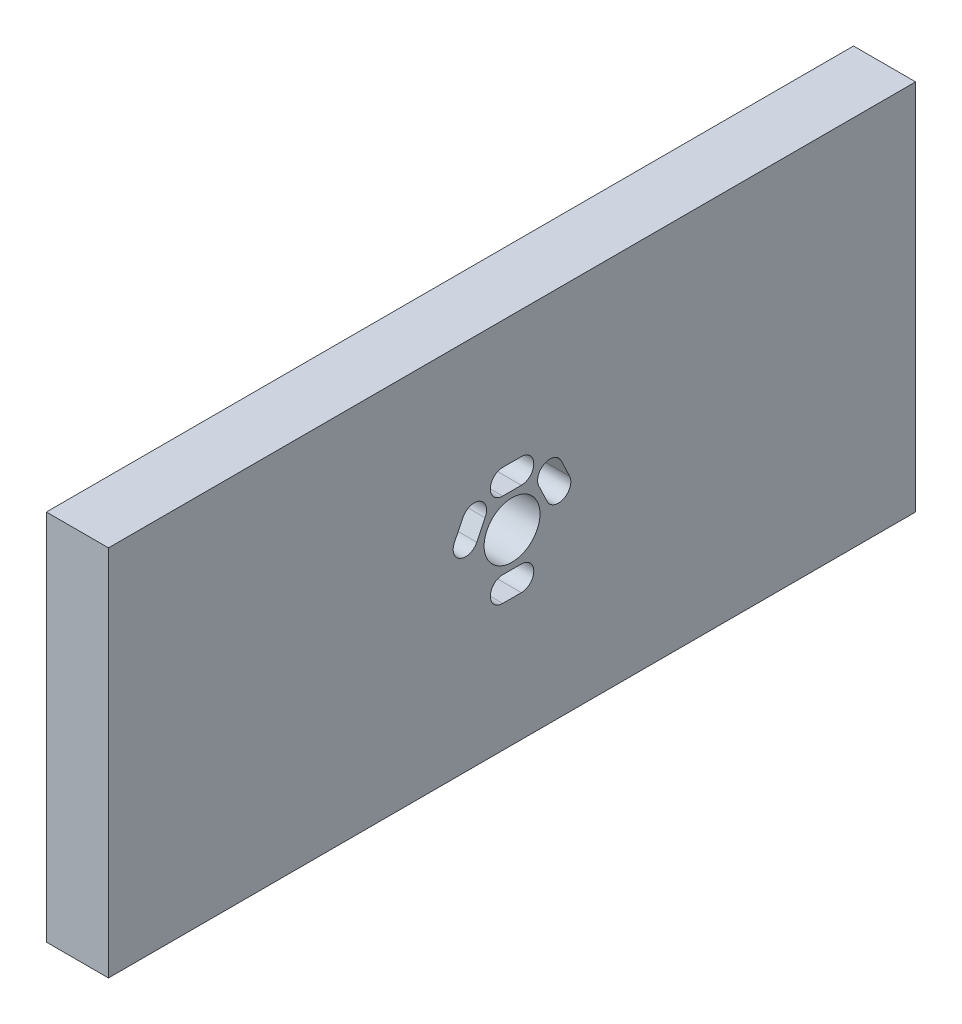
ISO-10303-21;
HEADER;
FILE_DESCRIPTION(('STEP AP214'),'2;1');
FILE_NAME('part.step','',(''),(''),'','','');
FILE_SCHEMA(('AUTOMOTIVE_DESIGN { 1 0 10303 214 1 1 1 1 }'));
ENDSEC;
DATA;
#1=APPLICATION_CONTEXT('core data for automotive mechanical design processes');
#2=APPLICATION_PROTOCOL_DEFINITION('international standard','automotive_design',2000,#1);
#3=PRODUCT_CONTEXT('',#1,'mechanical');
#4=PRODUCT('Part','Part','',(#3));
#5=PRODUCT_RELATED_PRODUCT_CATEGORY('part','',(#4));
#6=PRODUCT_DEFINITION_FORMATION('','',#4);
#7=PRODUCT_DEFINITION_CONTEXT('part definition',#1,'design');
#8=PRODUCT_DEFINITION('design','',#6,#7);
#9=PRODUCT_DEFINITION_SHAPE('','',#8);
#10=(LENGTH_UNIT() NAMED_UNIT(*) SI_UNIT(.MILLI.,.METRE.));
#11=(NAMED_UNIT(*) PLANE_ANGLE_UNIT() SI_UNIT($,.RADIAN.));
#12=(NAMED_UNIT(*) SI_UNIT($,.STERADIAN.) SOLID_ANGLE_UNIT());
#13=UNCERTAINTY_MEASURE_WITH_UNIT(LENGTH_MEASURE(1.E-05),#10,'distance_accuracy_value','');
#14=(GEOMETRIC_REPRESENTATION_CONTEXT(3) GLOBAL_UNCERTAINTY_ASSIGNED_CONTEXT((#13)) GLOBAL_UNIT_ASSIGNED_CONTEXT((#10,
#11,#12)) REPRESENTATION_CONTEXT('',''));
#15=CARTESIAN_POINT('',(0.,0.,0.));
#16=DIRECTION('',(0.,0.,1.));
#17=DIRECTION('',(1.,0.,0.));
#18=AXIS2_PLACEMENT_3D('',#15,#16,#17);
#19=CARTESIAN_POINT('',(10.,0.,0.));
#20=DIRECTION('',(1.,0.,0.));
#21=DIRECTION('',(0.,0.,-1.));
#22=AXIS2_PLACEMENT_3D('',#19,#20,#21);
#23=PLANE('',#22);
#24=DIRECTION('',(0.,0.902649656090385,0.430376112673449));
#25=VECTOR('',#24,1.);
#26=CARTESIAN_POINT('',(10.,33.5893000538088,-11.7336326254633));
#27=LINE('',#26,#25);
#28=CARTESIAN_POINT('',(10.,30.7583147353488,-13.0834237079433));
#29=VERTEX_POINT('',#28);
#30=CARTESIAN_POINT('',(10.,33.5893000538088,-11.7336326254633));
#31=VERTEX_POINT('',#30);
#32=EDGE_CURVE('E178',#29,#31,#27,.T.);
#33=ORIENTED_EDGE('',*,*,#32,.F.);
#34=CARTESIAN_POINT('',(10.,29.8982601486518,-11.277710689953));
#35=DIRECTION('',(1.,0.,0.));
#36=DIRECTION('',(0.,0.,-1.));
#37=AXIS2_PLACEMENT_3D('',#34,#35,#36);
#38=CIRCLE('',#37,2.00007334751453);
#39=CARTESIAN_POINT('',(10.,29.0382055619547,-9.47199767196282));
#40=VERTEX_POINT('',#39);
#41=EDGE_CURVE('E170',#40,#29,#38,.T.);
#42=ORIENTED_EDGE('',*,*,#41,.F.);
#43=DIRECTION('',(0.,-0.902996994662955,-0.429646863865747));
#44=VECTOR('',#43,1.);
#45=CARTESIAN_POINT('',(10.,29.0382055619547,-9.47199767196282));
#46=LINE('',#45,#44);
#47=CARTESIAN_POINT('',(10.,31.9615961769347,-8.08104552372279));
#48=VERTEX_POINT('',#47);
#49=EDGE_CURVE('E193',#48,#40,#46,.T.);
#50=ORIENTED_EDGE('',*,*,#49,.F.);
#51=CARTESIAN_POINT('',(10.,32.7289545054334,-9.92805804091433));
#52=DIRECTION('',(1.,0.,0.));
#53=DIRECTION('',(0.,0.,-1.));
#54=AXIS2_PLACEMENT_3D('',#51,#52,#53);
#55=CIRCLE('',#54,2.00007350939372);
#56=EDGE_CURVE('E191',#31,#48,#55,.T.);
#57=ORIENTED_EDGE('',*,*,#56,.F.);
#58=EDGE_LOOP('',(#33,#42,#50,#57));
#59=FACE_BOUND('',#58,.T.);
#60=DIRECTION('',(0.,0.,1.));
#61=VECTOR('',#60,1.);
#62=CARTESIAN_POINT('',(10.,22.3975308727947,-2.3131607907828));
#63=LINE('',#62,#61);
#64=CARTESIAN_POINT('',(10.,22.3975308727947,-5.31316079026278));
#65=VERTEX_POINT('',#64);
#66=CARTESIAN_POINT('',(10.,22.3975308727947,-2.3131607907828));
#67=VERTEX_POINT('',#66);
#68=EDGE_CURVE('E242',#65,#67,#63,.T.);
#69=ORIENTED_EDGE('',*,*,#68,.F.);
#70=CARTESIAN_POINT('',(10.,20.3975308735647,-5.31316079026278));
#71=DIRECTION('',(1.,0.,0.));
#72=DIRECTION('',(0.,0.,-1.));
#73=AXIS2_PLACEMENT_3D('',#70,#71,#72);
#74=CIRCLE('',#73,1.99999999922999);
#75=CARTESIAN_POINT('',(10.,18.3975308743347,-5.31316079026278));
#76=VERTEX_POINT('',#75);
#77=EDGE_CURVE('E240',#76,#65,#74,.T.);
#78=ORIENTED_EDGE('',*,*,#77,.F.);
#79=DIRECTION('',(0.,0.,-1.));
#80=VECTOR('',#79,1.);
#81=CARTESIAN_POINT('',(10.,18.3975308743347,-5.31316079026278));
#82=LINE('',#81,#80);
#83=CARTESIAN_POINT('',(10.,18.3975308743347,-2.3131607907828));
#84=VERTEX_POINT('',#83);
#85=EDGE_CURVE('E248',#84,#76,#82,.T.);
#86=ORIENTED_EDGE('',*,*,#85,.F.);
#87=CARTESIAN_POINT('',(10.,20.3975308735647,-2.3131607907828));
#88=DIRECTION('',(1.,0.,0.));
#89=DIRECTION('',(0.,0.,-1.));
#90=AXIS2_PLACEMENT_3D('',#87,#88,#89);
#91=CIRCLE('',#90,1.99999999922999);
#92=EDGE_CURVE('E245',#67,#84,#91,.T.);
#93=ORIENTED_EDGE('',*,*,#92,.F.);
#94=EDGE_LOOP('',(#69,#78,#86,#93));
#95=FACE_BOUND('',#94,.T.);
#96=DIRECTION('',(0.,-1.,0.));
#97=VECTOR('',#96,1.);
#98=CARTESIAN_POINT('',(10.,57.8975308735347,61.1868392094772));
#99=LINE('',#98,#97);
#100=CARTESIAN_POINT('',(10.,57.8975308735347,61.1868392094772));
#101=VERTEX_POINT('',#100);
#102=CARTESIAN_POINT('',(10.,-2.10246912646529,61.1868392094772));
#103=VERTEX_POINT('',#102);
#104=EDGE_CURVE('E302',#101,#103,#99,.T.);
#105=ORIENTED_EDGE('',*,*,#104,.T.);
#106=DIRECTION('',(0.,0.,-1.));
#107=VECTOR('',#106,1.);
#108=CARTESIAN_POINT('',(10.,-2.10246912646529,61.1868392094772));
#109=LINE('',#108,#107);
#110=CARTESIAN_POINT('',(10.,-2.10246912646529,-68.8131607905228));
#111=VERTEX_POINT('',#110);
#112=EDGE_CURVE('E305',#103,#111,#109,.T.);
#113=ORIENTED_EDGE('',*,*,#112,.T.);
#114=DIRECTION('',(0.,1.,0.));
#115=VECTOR('',#114,1.);
#116=CARTESIAN_POINT('',(10.,57.8975308735347,-68.8131607905228));
#117=LINE('',#116,#115);
#118=CARTESIAN_POINT('',(10.,57.8975308735347,-68.8131607905228));
#119=VERTEX_POINT('',#118);
#120=EDGE_CURVE('E308',#111,#119,#117,.T.);
#121=ORIENTED_EDGE('',*,*,#120,.T.);
#122=DIRECTION('',(0.,0.,1.));
#123=VECTOR('',#122,1.);
#124=CARTESIAN_POINT('',(10.,57.8975308735347,61.1868392094772));
#125=LINE('',#124,#123);
#126=EDGE_CURVE('E310',#119,#101,#125,.T.);
#127=ORIENTED_EDGE('',*,*,#126,.T.);
#128=EDGE_LOOP('',(#105,#113,#121,#127));
#129=FACE_BOUND('',#128,.T.);
#130=DIRECTION('',(0.,0.898794046520824,-0.438371146334613));
#131=VECTOR('',#130,1.);
#132=CARTESIAN_POINT('',(10.,31.7705559468743,0.528409533177395));
#133=LINE('',#132,#131);
#134=CARTESIAN_POINT('',(10.,29.0207563563143,1.86957640379742));
#135=VERTEX_POINT('',#134);
#136=CARTESIAN_POINT('',(10.,31.7705559468743,0.528409533177395));
#137=VERTEX_POINT('',#136);
#138=EDGE_CURVE('E273',#135,#137,#133,.T.);
#139=ORIENTED_EDGE('',*,*,#138,.F.);
#140=CARTESIAN_POINT('',(10.,29.8975308736699,3.66723056745029));
#141=DIRECTION('',(1.,0.,0.));
#142=DIRECTION('',(0.,0.,-1.));
#143=AXIS2_PLACEMENT_3D('',#140,#141,#142);
#144=CIRCLE('',#143,2.00007351024472);
#145=CARTESIAN_POINT('',(10.,30.7753413256747,5.46437910241722));
#146=VERTEX_POINT('',#145);
#147=EDGE_CURVE('E271',#146,#135,#144,.T.);
#148=ORIENTED_EDGE('',*,*,#147,.F.);
#149=DIRECTION('',(0.,-0.898541241299696,0.438889094970019));
#150=VECTOR('',#149,1.);
#151=CARTESIAN_POINT('',(10.,30.7753413256747,5.46437910241722));
#152=LINE('',#151,#150);
#153=CARTESIAN_POINT('',(10.,33.6063050236547,4.08160551541721));
#154=VERTEX_POINT('',#153);
#155=EDGE_CURVE('E279',#154,#146,#152,.T.);
#156=ORIENTED_EDGE('',*,*,#155,.F.);
#157=CARTESIAN_POINT('',(10.,32.7228387875237,2.28723056816493));
#158=DIRECTION('',(1.,0.,0.));
#159=DIRECTION('',(0.,0.,-1.));
#160=AXIS2_PLACEMENT_3D('',#157,#158,#159);
#161=CIRCLE('',#160,2.0000735090766);
#162=EDGE_CURVE('E276',#137,#154,#161,.T.);
#163=ORIENTED_EDGE('',*,*,#162,.F.);
#164=EDGE_LOOP('',(#139,#148,#156,#163));
#165=FACE_BOUND('',#164,.T.);
#166=DIRECTION('',(0.,0.,1.));
#167=VECTOR('',#166,1.);
#168=CARTESIAN_POINT('',(10.,37.3742487653747,-2.3131607907828));
#169=LINE('',#168,#167);
#170=CARTESIAN_POINT('',(10.,37.3742487653747,-5.31316079026278));
#171=VERTEX_POINT('',#170);
#172=CARTESIAN_POINT('',(10.,37.3742487653747,-2.3131607907828));
#173=VERTEX_POINT('',#172);
#174=EDGE_CURVE('E211',#171,#173,#169,.T.);
#175=ORIENTED_EDGE('',*,*,#174,.F.);
#176=CARTESIAN_POINT('',(10.,35.3742487648747,-5.31316079026278));
#177=DIRECTION('',(1.,0.,0.));
#178=DIRECTION('',(0.,0.,-1.));
#179=AXIS2_PLACEMENT_3D('',#176,#177,#178);
#180=CIRCLE('',#179,2.0000000005);
#181=CARTESIAN_POINT('',(10.,33.3742487643747,-5.31316079026278));
#182=VERTEX_POINT('',#181);
#183=EDGE_CURVE('E209',#182,#171,#180,.T.);
#184=ORIENTED_EDGE('',*,*,#183,.F.);
#185=DIRECTION('',(0.,0.,-1.));
#186=VECTOR('',#185,1.);
#187=CARTESIAN_POINT('',(10.,33.3742487643747,-5.31316079026278));
#188=LINE('',#187,#186);
#189=CARTESIAN_POINT('',(10.,33.3742487643747,-2.3131607907828));
#190=VERTEX_POINT('',#189);
#191=EDGE_CURVE('E217',#190,#182,#188,.T.);
#192=ORIENTED_EDGE('',*,*,#191,.F.);
#193=CARTESIAN_POINT('',(10.,35.3742487648747,-2.3131607907828));
#194=DIRECTION('',(1.,0.,0.));
#195=DIRECTION('',(0.,0.,-1.));
#196=AXIS2_PLACEMENT_3D('',#193,#194,#195);
#197=CIRCLE('',#196,2.0000000005);
#198=EDGE_CURVE('E214',#173,#190,#197,.T.);
#199=ORIENTED_EDGE('',*,*,#198,.F.);
#200=EDGE_LOOP('',(#175,#184,#192,#199));
#201=FACE_BOUND('',#200,.T.);
#202=CARTESIAN_POINT('',(10.,27.8975308735347,-3.81316079052279));
#203=DIRECTION('',(1.,0.,0.));
#204=DIRECTION('',(0.,0.,-1.));
#205=AXIS2_PLACEMENT_3D('',#202,#203,#204);
#206=CIRCLE('',#205,4.49999999921999);
#207=CARTESIAN_POINT('',(10.,27.8975308735347,-8.31316078974278));
#208=VERTEX_POINT('',#207);
#209=EDGE_CURVE('E199',#208,#208,#206,.T.);
#210=ORIENTED_EDGE('',*,*,#209,.F.);
#211=EDGE_LOOP('',(#210));
#212=FACE_BOUND('',#211,.T.);
#213=ADVANCED_FACE('F33',(#59,#95,#129,#165,#201,#212),#23,.T.);
#214=CARTESIAN_POINT('',(0.,0.,0.));
#215=DIRECTION('',(1.,0.,0.));
#216=DIRECTION('',(0.,0.,-1.));
#217=AXIS2_PLACEMENT_3D('',#214,#215,#216);
#218=PLANE('',#217);
#219=CARTESIAN_POINT('',(0.,29.8982601486518,-11.277710689953));
#220=DIRECTION('',(1.,0.,0.));
#221=DIRECTION('',(0.,0.,-1.));
#222=AXIS2_PLACEMENT_3D('',#219,#220,#221);
#223=CIRCLE('',#222,2.00007334751453);
#224=CARTESIAN_POINT('',(0.,29.0382055619547,-9.47199767196282));
#225=VERTEX_POINT('',#224);
#226=CARTESIAN_POINT('',(0.,30.7583147353488,-13.0834237079433));
#227=VERTEX_POINT('',#226);
#228=EDGE_CURVE('E56',#225,#227,#223,.T.);
#229=ORIENTED_EDGE('',*,*,#228,.T.);
#230=DIRECTION('',(0.,0.902649656090385,0.430376112673449));
#231=VECTOR('',#230,1.);
#232=CARTESIAN_POINT('',(0.,33.5893000538088,-11.7336326254633));
#233=LINE('',#232,#231);
#234=CARTESIAN_POINT('',(0.,33.5893000538088,-11.7336326254633));
#235=VERTEX_POINT('',#234);
#236=EDGE_CURVE('E185',#227,#235,#233,.T.);
#237=ORIENTED_EDGE('',*,*,#236,.T.);
#238=CARTESIAN_POINT('',(0.,32.7289545054334,-9.92805804091433));
#239=DIRECTION('',(1.,0.,0.));
#240=DIRECTION('',(0.,0.,-1.));
#241=AXIS2_PLACEMENT_3D('',#238,#239,#240);
#242=CIRCLE('',#241,2.00007350939372);
#243=CARTESIAN_POINT('',(0.,31.9615961769347,-8.08104552372279));
#244=VERTEX_POINT('',#243);
#245=EDGE_CURVE('E201',#235,#244,#242,.T.);
#246=ORIENTED_EDGE('',*,*,#245,.T.);
#247=DIRECTION('',(0.,-0.902996994662955,-0.429646863865747));
#248=VECTOR('',#247,1.);
#249=CARTESIAN_POINT('',(0.,29.0382055619547,-9.47199767196282));
#250=LINE('',#249,#248);
#251=EDGE_CURVE('E179',#244,#225,#250,.T.);
#252=ORIENTED_EDGE('',*,*,#251,.T.);
#253=EDGE_LOOP('',(#229,#237,#246,#252));
#254=FACE_BOUND('',#253,.T.);
#255=CARTESIAN_POINT('',(0.,20.3975308735647,-5.31316079026278));
#256=DIRECTION('',(1.,0.,0.));
#257=DIRECTION('',(0.,0.,-1.));
#258=AXIS2_PLACEMENT_3D('',#255,#256,#257);
#259=CIRCLE('',#258,1.99999999922999);
#260=CARTESIAN_POINT('',(0.,18.3975308743347,-5.31316079026278));
#261=VERTEX_POINT('',#260);
#262=CARTESIAN_POINT('',(0.,22.3975308727947,-5.31316079026278));
#263=VERTEX_POINT('',#262);
#264=EDGE_CURVE('E239',#261,#263,#259,.T.);
#265=ORIENTED_EDGE('',*,*,#264,.T.);
#266=DIRECTION('',(0.,0.,1.));
#267=VECTOR('',#266,1.);
#268=CARTESIAN_POINT('',(0.,22.3975308727947,-2.3131607907828));
#269=LINE('',#268,#267);
#270=CARTESIAN_POINT('',(0.,22.3975308727947,-2.3131607907828));
#271=VERTEX_POINT('',#270);
#272=EDGE_CURVE('E253',#263,#271,#269,.T.);
#273=ORIENTED_EDGE('',*,*,#272,.T.);
#274=CARTESIAN_POINT('',(0.,20.3975308735647,-2.3131607907828));
#275=DIRECTION('',(1.,0.,0.));
#276=DIRECTION('',(0.,0.,-1.));
#277=AXIS2_PLACEMENT_3D('',#274,#275,#276);
#278=CIRCLE('',#277,1.99999999922999);
#279=CARTESIAN_POINT('',(0.,18.3975308743347,-2.3131607907828));
#280=VERTEX_POINT('',#279);
#281=EDGE_CURVE('E256',#271,#280,#278,.T.);
#282=ORIENTED_EDGE('',*,*,#281,.T.);
#283=DIRECTION('',(0.,0.,-1.));
#284=VECTOR('',#283,1.);
#285=CARTESIAN_POINT('',(0.,18.3975308743347,-5.31316079026278));
#286=LINE('',#285,#284);
#287=EDGE_CURVE('E243',#280,#261,#286,.T.);
#288=ORIENTED_EDGE('',*,*,#287,.T.);
#289=EDGE_LOOP('',(#265,#273,#282,#288));
#290=FACE_BOUND('',#289,.T.);
#291=DIRECTION('',(0.,-1.,0.));
#292=VECTOR('',#291,1.);
#293=CARTESIAN_POINT('',(0.,57.8975308735347,61.1868392094772));
#294=LINE('',#293,#292);
#295=CARTESIAN_POINT('',(0.,57.8975308735347,61.1868392094772));
#296=VERTEX_POINT('',#295);
#297=CARTESIAN_POINT('',(0.,-2.10246912646529,61.1868392094772));
#298=VERTEX_POINT('',#297);
#299=EDGE_CURVE('E301',#296,#298,#294,.T.);
#300=ORIENTED_EDGE('',*,*,#299,.F.);
#301=DIRECTION('',(0.,0.,1.));
#302=VECTOR('',#301,1.);
#303=CARTESIAN_POINT('',(0.,57.8975308735347,61.1868392094772));
#304=LINE('',#303,#302);
#305=CARTESIAN_POINT('',(0.,57.8975308735347,-68.8131607905228));
#306=VERTEX_POINT('',#305);
#307=EDGE_CURVE('E306',#306,#296,#304,.T.);
#308=ORIENTED_EDGE('',*,*,#307,.F.);
#309=DIRECTION('',(0.,1.,0.));
#310=VECTOR('',#309,1.);
#311=CARTESIAN_POINT('',(0.,57.8975308735347,-68.8131607905228));
#312=LINE('',#311,#310);
#313=CARTESIAN_POINT('',(0.,-2.10246912646529,-68.8131607905228));
#314=VERTEX_POINT('',#313);
#315=EDGE_CURVE('E317',#314,#306,#312,.T.);
#316=ORIENTED_EDGE('',*,*,#315,.F.);
#317=DIRECTION('',(0.,0.,-1.));
#318=VECTOR('',#317,1.);
#319=CARTESIAN_POINT('',(0.,-2.10246912646529,61.1868392094772));
#320=LINE('',#319,#318);
#321=EDGE_CURVE('E315',#298,#314,#320,.T.);
#322=ORIENTED_EDGE('',*,*,#321,.F.);
#323=EDGE_LOOP('',(#300,#308,#316,#322));
#324=FACE_BOUND('',#323,.T.);
#325=CARTESIAN_POINT('',(0.,29.8975308736699,3.66723056745029));
#326=DIRECTION('',(1.,0.,0.));
#327=DIRECTION('',(0.,0.,-1.));
#328=AXIS2_PLACEMENT_3D('',#325,#326,#327);
#329=CIRCLE('',#328,2.00007351024472);
#330=CARTESIAN_POINT('',(0.,30.7753413256747,5.46437910241722));
#331=VERTEX_POINT('',#330);
#332=CARTESIAN_POINT('',(0.,29.0207563563143,1.86957640379742));
#333=VERTEX_POINT('',#332);
#334=EDGE_CURVE('E270',#331,#333,#329,.T.);
#335=ORIENTED_EDGE('',*,*,#334,.T.);
#336=DIRECTION('',(0.,0.898794046520824,-0.438371146334613));
#337=VECTOR('',#336,1.);
#338=CARTESIAN_POINT('',(0.,31.7705559468743,0.528409533177395));
#339=LINE('',#338,#337);
#340=CARTESIAN_POINT('',(0.,31.7705559468743,0.528409533177395));
#341=VERTEX_POINT('',#340);
#342=EDGE_CURVE('E284',#333,#341,#339,.T.);
#343=ORIENTED_EDGE('',*,*,#342,.T.);
#344=CARTESIAN_POINT('',(0.,32.7228387875237,2.28723056816493));
#345=DIRECTION('',(1.,0.,0.));
#346=DIRECTION('',(0.,0.,-1.));
#347=AXIS2_PLACEMENT_3D('',#344,#345,#346);
#348=CIRCLE('',#347,2.0000735090766);
#349=CARTESIAN_POINT('',(0.,33.6063050236547,4.08160551541721));
#350=VERTEX_POINT('',#349);
#351=EDGE_CURVE('E287',#341,#350,#348,.T.);
#352=ORIENTED_EDGE('',*,*,#351,.T.);
#353=DIRECTION('',(0.,-0.898541241299696,0.438889094970019));
#354=VECTOR('',#353,1.);
#355=CARTESIAN_POINT('',(0.,30.7753413256747,5.46437910241722));
#356=LINE('',#355,#354);
#357=EDGE_CURVE('E274',#350,#331,#356,.T.);
#358=ORIENTED_EDGE('',*,*,#357,.T.);
#359=EDGE_LOOP('',(#335,#343,#352,#358));
#360=FACE_BOUND('',#359,.T.);
#361=CARTESIAN_POINT('',(0.,35.3742487648747,-5.31316079026278));
#362=DIRECTION('',(1.,0.,0.));
#363=DIRECTION('',(0.,0.,-1.));
#364=AXIS2_PLACEMENT_3D('',#361,#362,#363);
#365=CIRCLE('',#364,2.0000000005);
#366=CARTESIAN_POINT('',(0.,33.3742487643747,-5.31316079026278));
#367=VERTEX_POINT('',#366);
#368=CARTESIAN_POINT('',(0.,37.3742487653747,-5.31316079026278));
#369=VERTEX_POINT('',#368);
#370=EDGE_CURVE('E186',#367,#369,#365,.T.);
#371=ORIENTED_EDGE('',*,*,#370,.T.);
#372=DIRECTION('',(0.,0.,1.));
#373=VECTOR('',#372,1.);
#374=CARTESIAN_POINT('',(0.,37.3742487653747,-2.3131607907828));
#375=LINE('',#374,#373);
#376=CARTESIAN_POINT('',(0.,37.3742487653747,-2.3131607907828));
#377=VERTEX_POINT('',#376);
#378=EDGE_CURVE('E222',#369,#377,#375,.T.);
#379=ORIENTED_EDGE('',*,*,#378,.T.);
#380=CARTESIAN_POINT('',(0.,35.3742487648747,-2.3131607907828));
#381=DIRECTION('',(1.,0.,0.));
#382=DIRECTION('',(0.,0.,-1.));
#383=AXIS2_PLACEMENT_3D('',#380,#381,#382);
#384=CIRCLE('',#383,2.0000000005);
#385=CARTESIAN_POINT('',(0.,33.3742487643747,-2.3131607907828));
#386=VERTEX_POINT('',#385);
#387=EDGE_CURVE('E225',#377,#386,#384,.T.);
#388=ORIENTED_EDGE('',*,*,#387,.T.);
#389=DIRECTION('',(0.,0.,-1.));
#390=VECTOR('',#389,1.);
#391=CARTESIAN_POINT('',(0.,33.3742487643747,-5.31316079026278));
#392=LINE('',#391,#390);
#393=EDGE_CURVE('E212',#386,#367,#392,.T.);
#394=ORIENTED_EDGE('',*,*,#393,.T.);
#395=EDGE_LOOP('',(#371,#379,#388,#394));
#396=FACE_BOUND('',#395,.T.);
#397=CARTESIAN_POINT('',(0.,27.8975308735347,-3.81316079052279));
#398=DIRECTION('',(1.,0.,0.));
#399=DIRECTION('',(0.,0.,-1.));
#400=AXIS2_PLACEMENT_3D('',#397,#398,#399);
#401=CIRCLE('',#400,4.49999999921999);
#402=CARTESIAN_POINT('',(0.,27.8975308735347,-8.31316078974278));
#403=VERTEX_POINT('',#402);
#404=EDGE_CURVE('E396',#403,#403,#401,.T.);
#405=ORIENTED_EDGE('',*,*,#404,.T.);
#406=EDGE_LOOP('',(#405));
#407=FACE_BOUND('',#406,.T.);
#408=ADVANCED_FACE('F335',(#254,#290,#324,#360,#396,#407),#218,.F.);
#409=CARTESIAN_POINT('',(10.,57.8975308735347,61.1868392094772));
#410=DIRECTION('',(0.,0.,-1.));
#411=DIRECTION('',(0.,1.,0.));
#412=AXIS2_PLACEMENT_3D('',#409,#410,#411);
#413=PLANE('',#412);
#414=ORIENTED_EDGE('',*,*,#299,.T.);
#415=DIRECTION('',(-1.,0.,0.));
#416=VECTOR('',#415,1.);
#417=CARTESIAN_POINT('',(10.,-2.10246912646529,61.1868392094772));
#418=LINE('',#417,#416);
#419=EDGE_CURVE('E11',#103,#298,#418,.T.);
#420=ORIENTED_EDGE('',*,*,#419,.F.);
#421=ORIENTED_EDGE('',*,*,#104,.F.);
#422=DIRECTION('',(-1.,0.,0.));
#423=VECTOR('',#422,1.);
#424=CARTESIAN_POINT('',(10.,57.8975308735347,61.1868392094772));
#425=LINE('',#424,#423);
#426=EDGE_CURVE('E312',#101,#296,#425,.T.);
#427=ORIENTED_EDGE('',*,*,#426,.T.);
#428=EDGE_LOOP('',(#414,#420,#421,#427));
#429=FACE_BOUND('',#428,.T.);
#430=ADVANCED_FACE('F35',(#429),#413,.F.);
#431=CARTESIAN_POINT('',(10.,-2.10246912646529,61.1868392094772));
#432=DIRECTION('',(0.,1.,0.));
#433=DIRECTION('',(0.,0.,1.));
#434=AXIS2_PLACEMENT_3D('',#431,#432,#433);
#435=PLANE('',#434);
#436=ORIENTED_EDGE('',*,*,#321,.T.);
#437=DIRECTION('',(-1.,0.,0.));
#438=VECTOR('',#437,1.);
#439=CARTESIAN_POINT('',(10.,-2.10246912646529,-68.8131607905228));
#440=LINE('',#439,#438);
#441=EDGE_CURVE('E41',#111,#314,#440,.T.);
#442=ORIENTED_EDGE('',*,*,#441,.F.);
#443=ORIENTED_EDGE('',*,*,#112,.F.);
#444=ORIENTED_EDGE('',*,*,#419,.T.);
#445=EDGE_LOOP('',(#436,#442,#443,#444));
#446=FACE_BOUND('',#445,.T.);
#447=ADVANCED_FACE('F346',(#446),#435,.F.);
#448=CARTESIAN_POINT('',(10.,57.8975308735347,-68.8131607905228));
#449=DIRECTION('',(0.,0.,1.));
#450=DIRECTION('',(1.,0.,0.));
#451=AXIS2_PLACEMENT_3D('',#448,#449,#450);
#452=PLANE('',#451);
#453=ORIENTED_EDGE('',*,*,#315,.T.);
#454=DIRECTION('',(-1.,0.,0.));
#455=VECTOR('',#454,1.);
#456=CARTESIAN_POINT('',(10.,57.8975308735347,-68.8131607905228));
#457=LINE('',#456,#455);
#458=EDGE_CURVE('E322',#119,#306,#457,.T.);
#459=ORIENTED_EDGE('',*,*,#458,.F.);
#460=ORIENTED_EDGE('',*,*,#120,.F.);
#461=ORIENTED_EDGE('',*,*,#441,.T.);
#462=EDGE_LOOP('',(#453,#459,#460,#461));
#463=FACE_BOUND('',#462,.T.);
#464=ADVANCED_FACE('F329',(#463),#452,.F.);
#465=CARTESIAN_POINT('',(10.,57.8975308735347,61.1868392094772));
#466=DIRECTION('',(0.,-1.,0.));
#467=DIRECTION('',(0.,0.,-1.));
#468=AXIS2_PLACEMENT_3D('',#465,#466,#467);
#469=PLANE('',#468);
#470=ORIENTED_EDGE('',*,*,#307,.T.);
#471=ORIENTED_EDGE('',*,*,#426,.F.);
#472=ORIENTED_EDGE('',*,*,#126,.F.);
#473=ORIENTED_EDGE('',*,*,#458,.T.);
#474=EDGE_LOOP('',(#470,#471,#472,#473));
#475=FACE_BOUND('',#474,.T.);
#476=ADVANCED_FACE('F339',(#475),#469,.F.);
#477=CARTESIAN_POINT('',(10.,29.8975308736699,3.66723056745029));
#478=DIRECTION('',(-1.,0.,0.));
#479=DIRECTION('',(0.,0.,1.));
#480=AXIS2_PLACEMENT_3D('',#477,#478,#479);
#481=CYLINDRICAL_SURFACE('',#480,2.00007351024472);
#482=ORIENTED_EDGE('',*,*,#334,.F.);
#483=DIRECTION('',(-1.,0.,0.));
#484=VECTOR('',#483,1.);
#485=CARTESIAN_POINT('',(10.,30.7753413256747,5.46437910241722));
#486=LINE('',#485,#484);
#487=EDGE_CURVE('E281',#146,#331,#486,.T.);
#488=ORIENTED_EDGE('',*,*,#487,.F.);
#489=ORIENTED_EDGE('',*,*,#147,.T.);
#490=DIRECTION('',(-1.,0.,0.));
#491=VECTOR('',#490,1.);
#492=CARTESIAN_POINT('',(10.,29.0207563563143,1.86957640379742));
#493=LINE('',#492,#491);
#494=EDGE_CURVE('E298',#135,#333,#493,.T.);
#495=ORIENTED_EDGE('',*,*,#494,.T.);
#496=EDGE_LOOP('',(#482,#488,#489,#495));
#497=FACE_BOUND('',#496,.T.);
#498=ADVANCED_FACE('F361',(#497),#481,.F.);
#499=CARTESIAN_POINT('',(10.,31.7705559468743,0.528409533177395));
#500=DIRECTION('',(0.,0.438371146334613,0.898794046520824));
#501=DIRECTION('',(0.,-0.898794046520824,0.438371146334613));
#502=AXIS2_PLACEMENT_3D('',#499,#500,#501);
#503=PLANE('',#502);
#504=ORIENTED_EDGE('',*,*,#342,.F.);
#505=ORIENTED_EDGE('',*,*,#494,.F.);
#506=ORIENTED_EDGE('',*,*,#138,.T.);
#507=DIRECTION('',(-1.,0.,0.));
#508=VECTOR('',#507,1.);
#509=CARTESIAN_POINT('',(10.,31.7705559468743,0.528409533177395));
#510=LINE('',#509,#508);
#511=EDGE_CURVE('E296',#137,#341,#510,.T.);
#512=ORIENTED_EDGE('',*,*,#511,.T.);
#513=EDGE_LOOP('',(#504,#505,#506,#512));
#514=FACE_BOUND('',#513,.T.);
#515=ADVANCED_FACE('F368',(#514),#503,.T.);
#516=CARTESIAN_POINT('',(10.,32.7228387875237,2.28723056816493));
#517=DIRECTION('',(-1.,0.,0.));
#518=DIRECTION('',(0.,0.,1.));
#519=AXIS2_PLACEMENT_3D('',#516,#517,#518);
#520=CYLINDRICAL_SURFACE('',#519,2.0000735090766);
#521=ORIENTED_EDGE('',*,*,#351,.F.);
#522=ORIENTED_EDGE('',*,*,#511,.F.);
#523=ORIENTED_EDGE('',*,*,#162,.T.);
#524=DIRECTION('',(-1.,0.,0.));
#525=VECTOR('',#524,1.);
#526=CARTESIAN_POINT('',(10.,33.6063050236547,4.08160551541721));
#527=LINE('',#526,#525);
#528=EDGE_CURVE('E294',#154,#350,#527,.T.);
#529=ORIENTED_EDGE('',*,*,#528,.T.);
#530=EDGE_LOOP('',(#521,#522,#523,#529));
#531=FACE_BOUND('',#530,.T.);
#532=ADVANCED_FACE('F373',(#531),#520,.F.);
#533=CARTESIAN_POINT('',(10.,30.7753413256747,5.46437910241722));
#534=DIRECTION('',(0.,-0.438889094970019,-0.898541241299696));
#535=DIRECTION('',(0.,0.898541241299696,-0.438889094970019));
#536=AXIS2_PLACEMENT_3D('',#533,#534,#535);
#537=PLANE('',#536);
#538=ORIENTED_EDGE('',*,*,#357,.F.);
#539=ORIENTED_EDGE('',*,*,#528,.F.);
#540=ORIENTED_EDGE('',*,*,#155,.T.);
#541=ORIENTED_EDGE('',*,*,#487,.T.);
#542=EDGE_LOOP('',(#538,#539,#540,#541));
#543=FACE_BOUND('',#542,.T.);
#544=ADVANCED_FACE('F380',(#543),#537,.T.);
#545=CARTESIAN_POINT('',(10.,20.3975308735647,-5.31316079026278));
#546=DIRECTION('',(-1.,0.,0.));
#547=DIRECTION('',(0.,0.,1.));
#548=AXIS2_PLACEMENT_3D('',#545,#546,#547);
#549=CYLINDRICAL_SURFACE('',#548,1.99999999922999);
#550=ORIENTED_EDGE('',*,*,#264,.F.);
#551=DIRECTION('',(-1.,0.,0.));
#552=VECTOR('',#551,1.);
#553=CARTESIAN_POINT('',(10.,18.3975308743347,-5.31316079026278));
#554=LINE('',#553,#552);
#555=EDGE_CURVE('E250',#76,#261,#554,.T.);
#556=ORIENTED_EDGE('',*,*,#555,.F.);
#557=ORIENTED_EDGE('',*,*,#77,.T.);
#558=DIRECTION('',(-1.,0.,0.));
#559=VECTOR('',#558,1.);
#560=CARTESIAN_POINT('',(10.,22.3975308727947,-5.31316079026278));
#561=LINE('',#560,#559);
#562=EDGE_CURVE('E267',#65,#263,#561,.T.);
#563=ORIENTED_EDGE('',*,*,#562,.T.);
#564=EDGE_LOOP('',(#550,#556,#557,#563));
#565=FACE_BOUND('',#564,.T.);
#566=ADVANCED_FACE('F446',(#565),#549,.F.);
#567=CARTESIAN_POINT('',(10.,22.3975308727947,-2.3131607907828));
#568=DIRECTION('',(0.,-1.,0.));
#569=DIRECTION('',(0.,0.,-1.));
#570=AXIS2_PLACEMENT_3D('',#567,#568,#569);
#571=PLANE('',#570);
#572=ORIENTED_EDGE('',*,*,#272,.F.);
#573=ORIENTED_EDGE('',*,*,#562,.F.);
#574=ORIENTED_EDGE('',*,*,#68,.T.);
#575=DIRECTION('',(-1.,0.,0.));
#576=VECTOR('',#575,1.);
#577=CARTESIAN_POINT('',(10.,22.3975308727947,-2.3131607907828));
#578=LINE('',#577,#576);
#579=EDGE_CURVE('E265',#67,#271,#578,.T.);
#580=ORIENTED_EDGE('',*,*,#579,.T.);
#581=EDGE_LOOP('',(#572,#573,#574,#580));
#582=FACE_BOUND('',#581,.T.);
#583=ADVANCED_FACE('F442',(#582),#571,.T.);
#584=CARTESIAN_POINT('',(10.,20.3975308735647,-2.3131607907828));
#585=DIRECTION('',(-1.,0.,0.));
#586=DIRECTION('',(0.,0.,1.));
#587=AXIS2_PLACEMENT_3D('',#584,#585,#586);
#588=CYLINDRICAL_SURFACE('',#587,1.99999999922999);
#589=ORIENTED_EDGE('',*,*,#281,.F.);
#590=ORIENTED_EDGE('',*,*,#579,.F.);
#591=ORIENTED_EDGE('',*,*,#92,.T.);
#592=DIRECTION('',(-1.,0.,0.));
#593=VECTOR('',#592,1.);
#594=CARTESIAN_POINT('',(10.,18.3975308743347,-2.3131607907828));
#595=LINE('',#594,#593);
#596=EDGE_CURVE('E263',#84,#280,#595,.T.);
#597=ORIENTED_EDGE('',*,*,#596,.T.);
#598=EDGE_LOOP('',(#589,#590,#591,#597));
#599=FACE_BOUND('',#598,.T.);
#600=ADVANCED_FACE('F438',(#599),#588,.F.);
#601=CARTESIAN_POINT('',(10.,18.3975308743347,-5.31316079026278));
#602=DIRECTION('',(0.,1.,0.));
#603=DIRECTION('',(0.,0.,1.));
#604=AXIS2_PLACEMENT_3D('',#601,#602,#603);
#605=PLANE('',#604);
#606=ORIENTED_EDGE('',*,*,#287,.F.);
#607=ORIENTED_EDGE('',*,*,#596,.F.);
#608=ORIENTED_EDGE('',*,*,#85,.T.);
#609=ORIENTED_EDGE('',*,*,#555,.T.);
#610=EDGE_LOOP('',(#606,#607,#608,#609));
#611=FACE_BOUND('',#610,.T.);
#612=ADVANCED_FACE('F434',(#611),#605,.T.);
#613=CARTESIAN_POINT('',(10.,35.3742487648747,-5.31316079026278));
#614=DIRECTION('',(-1.,0.,0.));
#615=DIRECTION('',(0.,0.,1.));
#616=AXIS2_PLACEMENT_3D('',#613,#614,#615);
#617=CYLINDRICAL_SURFACE('',#616,2.0000000005);
#618=ORIENTED_EDGE('',*,*,#370,.F.);
#619=DIRECTION('',(-1.,0.,0.));
#620=VECTOR('',#619,1.);
#621=CARTESIAN_POINT('',(10.,33.3742487643747,-5.31316079026278));
#622=LINE('',#621,#620);
#623=EDGE_CURVE('E219',#182,#367,#622,.T.);
#624=ORIENTED_EDGE('',*,*,#623,.F.);
#625=ORIENTED_EDGE('',*,*,#183,.T.);
#626=DIRECTION('',(-1.,0.,0.));
#627=VECTOR('',#626,1.);
#628=CARTESIAN_POINT('',(10.,37.3742487653747,-5.31316079026278));
#629=LINE('',#628,#627);
#630=EDGE_CURVE('E236',#171,#369,#629,.T.);
#631=ORIENTED_EDGE('',*,*,#630,.T.);
#632=EDGE_LOOP('',(#618,#624,#625,#631));
#633=FACE_BOUND('',#632,.T.);
#634=ADVANCED_FACE('F430',(#633),#617,.F.);
#635=CARTESIAN_POINT('',(10.,37.3742487653747,-2.3131607907828));
#636=DIRECTION('',(0.,-1.,0.));
#637=DIRECTION('',(0.,0.,-1.));
#638=AXIS2_PLACEMENT_3D('',#635,#636,#637);
#639=PLANE('',#638);
#640=ORIENTED_EDGE('',*,*,#378,.F.);
#641=ORIENTED_EDGE('',*,*,#630,.F.);
#642=ORIENTED_EDGE('',*,*,#174,.T.);
#643=DIRECTION('',(-1.,0.,0.));
#644=VECTOR('',#643,1.);
#645=CARTESIAN_POINT('',(10.,37.3742487653747,-2.3131607907828));
#646=LINE('',#645,#644);
#647=EDGE_CURVE('E234',#173,#377,#646,.T.);
#648=ORIENTED_EDGE('',*,*,#647,.T.);
#649=EDGE_LOOP('',(#640,#641,#642,#648));
#650=FACE_BOUND('',#649,.T.);
#651=ADVANCED_FACE('F426',(#650),#639,.T.);
#652=CARTESIAN_POINT('',(10.,35.3742487648747,-2.3131607907828));
#653=DIRECTION('',(-1.,0.,0.));
#654=DIRECTION('',(0.,0.,1.));
#655=AXIS2_PLACEMENT_3D('',#652,#653,#654);
#656=CYLINDRICAL_SURFACE('',#655,2.0000000005);
#657=ORIENTED_EDGE('',*,*,#387,.F.);
#658=ORIENTED_EDGE('',*,*,#647,.F.);
#659=ORIENTED_EDGE('',*,*,#198,.T.);
#660=DIRECTION('',(-1.,0.,0.));
#661=VECTOR('',#660,1.);
#662=CARTESIAN_POINT('',(10.,33.3742487643747,-2.3131607907828));
#663=LINE('',#662,#661);
#664=EDGE_CURVE('E232',#190,#386,#663,.T.);
#665=ORIENTED_EDGE('',*,*,#664,.T.);
#666=EDGE_LOOP('',(#657,#658,#659,#665));
#667=FACE_BOUND('',#666,.T.);
#668=ADVANCED_FACE('F422',(#667),#656,.F.);
#669=CARTESIAN_POINT('',(10.,33.3742487643747,-5.31316079026278));
#670=DIRECTION('',(0.,1.,0.));
#671=DIRECTION('',(0.,0.,1.));
#672=AXIS2_PLACEMENT_3D('',#669,#670,#671);
#673=PLANE('',#672);
#674=ORIENTED_EDGE('',*,*,#393,.F.);
#675=ORIENTED_EDGE('',*,*,#664,.F.);
#676=ORIENTED_EDGE('',*,*,#191,.T.);
#677=ORIENTED_EDGE('',*,*,#623,.T.);
#678=EDGE_LOOP('',(#674,#675,#676,#677));
#679=FACE_BOUND('',#678,.T.);
#680=ADVANCED_FACE('F419',(#679),#673,.T.);
#681=CARTESIAN_POINT('',(10.,29.8982601486518,-11.277710689953));
#682=DIRECTION('',(-1.,0.,0.));
#683=DIRECTION('',(0.,0.,1.));
#684=AXIS2_PLACEMENT_3D('',#681,#682,#683);
#685=CYLINDRICAL_SURFACE('',#684,2.00007334751453);
#686=ORIENTED_EDGE('',*,*,#228,.F.);
#687=DIRECTION('',(-1.,0.,0.));
#688=VECTOR('',#687,1.);
#689=CARTESIAN_POINT('',(10.,29.0382055619547,-9.47199767196282));
#690=LINE('',#689,#688);
#691=EDGE_CURVE('E174',#40,#225,#690,.T.);
#692=ORIENTED_EDGE('',*,*,#691,.F.);
#693=ORIENTED_EDGE('',*,*,#41,.T.);
#694=DIRECTION('',(-1.,0.,0.));
#695=VECTOR('',#694,1.);
#696=CARTESIAN_POINT('',(10.,30.7583147353488,-13.0834237079433));
#697=LINE('',#696,#695);
#698=EDGE_CURVE('E173',#29,#227,#697,.T.);
#699=ORIENTED_EDGE('',*,*,#698,.T.);
#700=EDGE_LOOP('',(#686,#692,#693,#699));
#701=FACE_BOUND('',#700,.T.);
#702=ADVANCED_FACE('F172',(#701),#685,.F.);
#703=CARTESIAN_POINT('',(10.,33.5893000538088,-11.7336326254633));
#704=DIRECTION('',(0.,-0.430376112673449,0.902649656090385));
#705=DIRECTION('',(0.,-0.902649656090385,-0.430376112673449));
#706=AXIS2_PLACEMENT_3D('',#703,#704,#705);
#707=PLANE('',#706);
#708=ORIENTED_EDGE('',*,*,#236,.F.);
#709=ORIENTED_EDGE('',*,*,#698,.F.);
#710=ORIENTED_EDGE('',*,*,#32,.T.);
#711=DIRECTION('',(-1.,0.,0.));
#712=VECTOR('',#711,1.);
#713=CARTESIAN_POINT('',(10.,33.5893000538088,-11.7336326254633));
#714=LINE('',#713,#712);
#715=EDGE_CURVE('E187',#31,#235,#714,.T.);
#716=ORIENTED_EDGE('',*,*,#715,.T.);
#717=EDGE_LOOP('',(#708,#709,#710,#716));
#718=FACE_BOUND('',#717,.T.);
#719=ADVANCED_FACE('F182',(#718),#707,.T.);
#720=CARTESIAN_POINT('',(10.,32.7289545054334,-9.92805804091433));
#721=DIRECTION('',(-1.,0.,0.));
#722=DIRECTION('',(0.,0.,1.));
#723=AXIS2_PLACEMENT_3D('',#720,#721,#722);
#724=CYLINDRICAL_SURFACE('',#723,2.00007350939372);
#725=ORIENTED_EDGE('',*,*,#245,.F.);
#726=ORIENTED_EDGE('',*,*,#715,.F.);
#727=ORIENTED_EDGE('',*,*,#56,.T.);
#728=DIRECTION('',(-1.,0.,0.));
#729=VECTOR('',#728,1.);
#730=CARTESIAN_POINT('',(10.,31.9615961769347,-8.08104552372279));
#731=LINE('',#730,#729);
#732=EDGE_CURVE('E48',#48,#244,#731,.T.);
#733=ORIENTED_EDGE('',*,*,#732,.T.);
#734=EDGE_LOOP('',(#725,#726,#727,#733));
#735=FACE_BOUND('',#734,.T.);
#736=ADVANCED_FACE('F409',(#735),#724,.F.);
#737=CARTESIAN_POINT('',(10.,29.0382055619547,-9.47199767196282));
#738=DIRECTION('',(0.,0.429646863865747,-0.902996994662955));
#739=DIRECTION('',(0.,0.902996994662955,0.429646863865747));
#740=AXIS2_PLACEMENT_3D('',#737,#738,#739);
#741=PLANE('',#740);
#742=ORIENTED_EDGE('',*,*,#251,.F.);
#743=ORIENTED_EDGE('',*,*,#732,.F.);
#744=ORIENTED_EDGE('',*,*,#49,.T.);
#745=ORIENTED_EDGE('',*,*,#691,.T.);
#746=EDGE_LOOP('',(#742,#743,#744,#745));
#747=FACE_BOUND('',#746,.T.);
#748=ADVANCED_FACE('F404',(#747),#741,.T.);
#749=CARTESIAN_POINT('',(10.,27.8975308735347,-3.81316079052279));
#750=DIRECTION('',(-1.,0.,0.));
#751=DIRECTION('',(0.,0.,1.));
#752=AXIS2_PLACEMENT_3D('',#749,#750,#751);
#753=CYLINDRICAL_SURFACE('',#752,4.49999999921999);
#754=ORIENTED_EDGE('',*,*,#209,.T.);
#755=EDGE_LOOP('',(#754));
#756=FACE_BOUND('',#755,.T.);
#757=ORIENTED_EDGE('',*,*,#404,.F.);
#758=EDGE_LOOP('',(#757));
#759=FACE_BOUND('',#758,.T.);
#760=ADVANCED_FACE('F402',(#756,#759),#753,.F.);
#761=CLOSED_SHELL('',(#213,#408,#430,#447,#464,#476,#498,#515,#532,#544,#566,#583,#600,#612,
#634,#651,#668,#680,#702,#719,#736,#748,#760));
#762=MANIFOLD_SOLID_BREP('B2',#761);
#763=ADVANCED_BREP_SHAPE_REPRESENTATION('',(#18,#762),#14);
#764=SHAPE_DEFINITION_REPRESENTATION(#9,#763);
ENDSEC;
END-ISO-10303-21;
